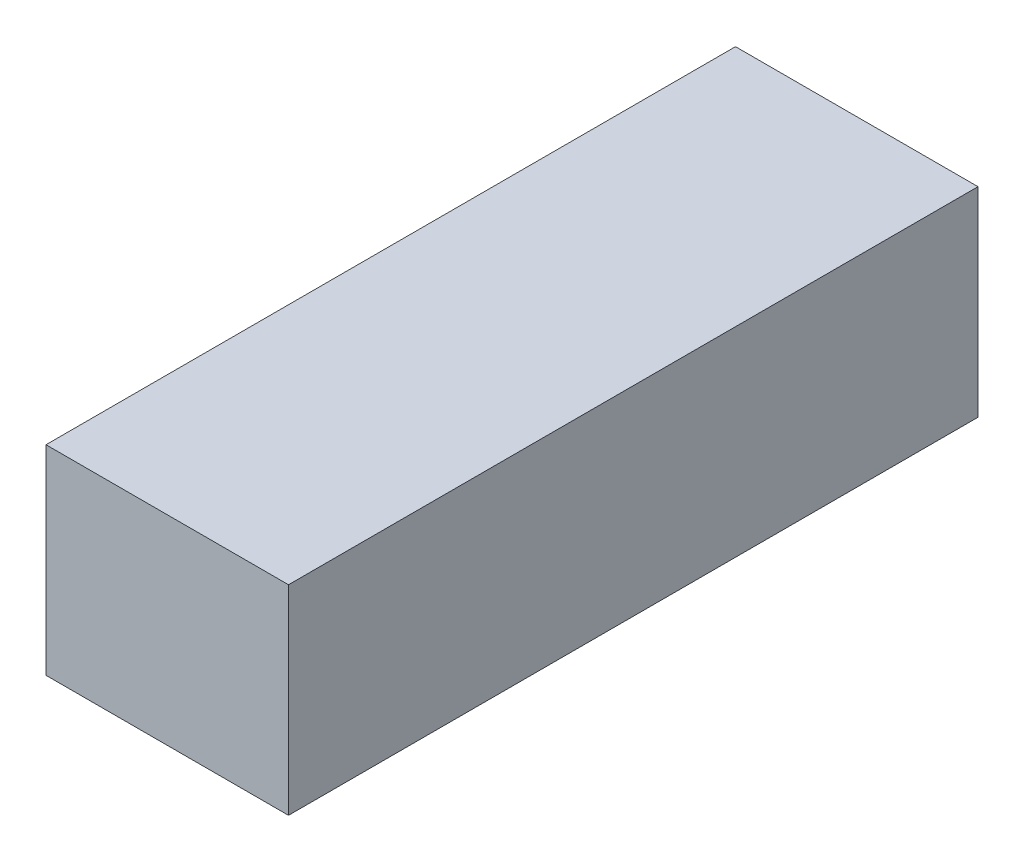
ISO-10303-21;
HEADER;
FILE_DESCRIPTION(('STEP AP214'),'2;1');
FILE_NAME('part.step','',(''),(''),'','','');
FILE_SCHEMA(('AUTOMOTIVE_DESIGN { 1 0 10303 214 1 1 1 1 }'));
ENDSEC;
DATA;
#1=APPLICATION_CONTEXT('core data for automotive mechanical design processes');
#2=APPLICATION_PROTOCOL_DEFINITION('international standard','automotive_design',2000,#1);
#3=PRODUCT_CONTEXT('',#1,'mechanical');
#4=PRODUCT('Part','Part','',(#3));
#5=PRODUCT_RELATED_PRODUCT_CATEGORY('part','',(#4));
#6=PRODUCT_DEFINITION_FORMATION('','',#4);
#7=PRODUCT_DEFINITION_CONTEXT('part definition',#1,'design');
#8=PRODUCT_DEFINITION('design','',#6,#7);
#9=PRODUCT_DEFINITION_SHAPE('','',#8);
#10=(LENGTH_UNIT() NAMED_UNIT(*) SI_UNIT(.MILLI.,.METRE.));
#11=(NAMED_UNIT(*) PLANE_ANGLE_UNIT() SI_UNIT($,.RADIAN.));
#12=(NAMED_UNIT(*) SI_UNIT($,.STERADIAN.) SOLID_ANGLE_UNIT());
#13=UNCERTAINTY_MEASURE_WITH_UNIT(LENGTH_MEASURE(1.E-05),#10,'distance_accuracy_value','');
#14=(GEOMETRIC_REPRESENTATION_CONTEXT(3) GLOBAL_UNCERTAINTY_ASSIGNED_CONTEXT((#13)) GLOBAL_UNIT_ASSIGNED_CONTEXT((#10,
#11,#12)) REPRESENTATION_CONTEXT('',''));
#15=CARTESIAN_POINT('',(0.,0.,0.));
#16=DIRECTION('',(0.,0.,1.));
#17=DIRECTION('',(1.,0.,0.));
#18=AXIS2_PLACEMENT_3D('',#15,#16,#17);
#19=CARTESIAN_POINT('',(25.5,-21.,145.));
#20=DIRECTION('',(-1.,0.,0.));
#21=DIRECTION('',(0.,0.,1.));
#22=AXIS2_PLACEMENT_3D('',#19,#20,#21);
#23=PLANE('',#22);
#24=DIRECTION('',(0.,1.,0.));
#25=VECTOR('',#24,1.);
#26=CARTESIAN_POINT('',(25.5,-21.,0.));
#27=LINE('',#26,#25);
#28=CARTESIAN_POINT('',(25.5,-21.,0.));
#29=VERTEX_POINT('',#28);
#30=CARTESIAN_POINT('',(25.5,21.,0.));
#31=VERTEX_POINT('',#30);
#32=EDGE_CURVE('E107',#29,#31,#27,.T.);
#33=ORIENTED_EDGE('',*,*,#32,.T.);
#34=DIRECTION('',(0.,0.,-1.));
#35=VECTOR('',#34,1.);
#36=CARTESIAN_POINT('',(25.5,21.,145.));
#37=LINE('',#36,#35);
#38=CARTESIAN_POINT('',(25.5,21.,145.));
#39=VERTEX_POINT('',#38);
#40=EDGE_CURVE('E11',#39,#31,#37,.T.);
#41=ORIENTED_EDGE('',*,*,#40,.F.);
#42=DIRECTION('',(0.,1.,0.));
#43=VECTOR('',#42,1.);
#44=CARTESIAN_POINT('',(25.5,-21.,145.));
#45=LINE('',#44,#43);
#46=CARTESIAN_POINT('',(25.5,-21.,145.));
#47=VERTEX_POINT('',#46);
#48=EDGE_CURVE('E91',#47,#39,#45,.T.);
#49=ORIENTED_EDGE('',*,*,#48,.F.);
#50=DIRECTION('',(0.,0.,-1.));
#51=VECTOR('',#50,1.);
#52=CARTESIAN_POINT('',(25.5,-21.,145.));
#53=LINE('',#52,#51);
#54=EDGE_CURVE('E103',#47,#29,#53,.T.);
#55=ORIENTED_EDGE('',*,*,#54,.T.);
#56=EDGE_LOOP('',(#33,#41,#49,#55));
#57=FACE_BOUND('',#56,.T.);
#58=ADVANCED_FACE('F39',(#57),#23,.F.);
#59=CARTESIAN_POINT('',(-25.5,21.,145.));
#60=DIRECTION('',(0.,-1.,0.));
#61=DIRECTION('',(0.,0.,-1.));
#62=AXIS2_PLACEMENT_3D('',#59,#60,#61);
#63=PLANE('',#62);
#64=DIRECTION('',(-1.,0.,0.));
#65=VECTOR('',#64,1.);
#66=CARTESIAN_POINT('',(-25.5,21.,0.));
#67=LINE('',#66,#65);
#68=CARTESIAN_POINT('',(-25.5,21.,0.));
#69=VERTEX_POINT('',#68);
#70=EDGE_CURVE('E96',#31,#69,#67,.T.);
#71=ORIENTED_EDGE('',*,*,#70,.T.);
#72=DIRECTION('',(0.,0.,-1.));
#73=VECTOR('',#72,1.);
#74=CARTESIAN_POINT('',(-25.5,21.,145.));
#75=LINE('',#74,#73);
#76=CARTESIAN_POINT('',(-25.5,21.,145.));
#77=VERTEX_POINT('',#76);
#78=EDGE_CURVE('E48',#77,#69,#75,.T.);
#79=ORIENTED_EDGE('',*,*,#78,.F.);
#80=DIRECTION('',(-1.,0.,0.));
#81=VECTOR('',#80,1.);
#82=CARTESIAN_POINT('',(-25.5,21.,145.));
#83=LINE('',#82,#81);
#84=EDGE_CURVE('E86',#39,#77,#83,.T.);
#85=ORIENTED_EDGE('',*,*,#84,.F.);
#86=ORIENTED_EDGE('',*,*,#40,.T.);
#87=EDGE_LOOP('',(#71,#79,#85,#86));
#88=FACE_BOUND('',#87,.T.);
#89=ADVANCED_FACE('F95',(#88),#63,.F.);
#90=CARTESIAN_POINT('',(-25.5,-21.,145.));
#91=DIRECTION('',(1.,0.,0.));
#92=DIRECTION('',(0.,0.,-1.));
#93=AXIS2_PLACEMENT_3D('',#90,#91,#92);
#94=PLANE('',#93);
#95=DIRECTION('',(0.,-1.,0.));
#96=VECTOR('',#95,1.);
#97=CARTESIAN_POINT('',(-25.5,-21.,0.));
#98=LINE('',#97,#96);
#99=CARTESIAN_POINT('',(-25.5,-21.,0.));
#100=VERTEX_POINT('',#99);
#101=EDGE_CURVE('E73',#69,#100,#98,.T.);
#102=ORIENTED_EDGE('',*,*,#101,.T.);
#103=DIRECTION('',(0.,0.,-1.));
#104=VECTOR('',#103,1.);
#105=CARTESIAN_POINT('',(-25.5,-21.,145.));
#106=LINE('',#105,#104);
#107=CARTESIAN_POINT('',(-25.5,-21.,145.));
#108=VERTEX_POINT('',#107);
#109=EDGE_CURVE('E98',#108,#100,#106,.T.);
#110=ORIENTED_EDGE('',*,*,#109,.F.);
#111=DIRECTION('',(0.,-1.,0.));
#112=VECTOR('',#111,1.);
#113=CARTESIAN_POINT('',(-25.5,-21.,145.));
#114=LINE('',#113,#112);
#115=EDGE_CURVE('E89',#77,#108,#114,.T.);
#116=ORIENTED_EDGE('',*,*,#115,.F.);
#117=ORIENTED_EDGE('',*,*,#78,.T.);
#118=EDGE_LOOP('',(#102,#110,#116,#117));
#119=FACE_BOUND('',#118,.T.);
#120=ADVANCED_FACE('F99',(#119),#94,.F.);
#121=CARTESIAN_POINT('',(-25.5,-21.,145.));
#122=DIRECTION('',(0.,1.,0.));
#123=DIRECTION('',(0.,0.,1.));
#124=AXIS2_PLACEMENT_3D('',#121,#122,#123);
#125=PLANE('',#124);
#126=DIRECTION('',(1.,0.,0.));
#127=VECTOR('',#126,1.);
#128=CARTESIAN_POINT('',(-25.5,-21.,0.));
#129=LINE('',#128,#127);
#130=EDGE_CURVE('E79',#100,#29,#129,.T.);
#131=ORIENTED_EDGE('',*,*,#130,.T.);
#132=ORIENTED_EDGE('',*,*,#54,.F.);
#133=DIRECTION('',(1.,0.,0.));
#134=VECTOR('',#133,1.);
#135=CARTESIAN_POINT('',(-25.5,-21.,145.));
#136=LINE('',#135,#134);
#137=EDGE_CURVE('E56',#108,#47,#136,.T.);
#138=ORIENTED_EDGE('',*,*,#137,.F.);
#139=ORIENTED_EDGE('',*,*,#109,.T.);
#140=EDGE_LOOP('',(#131,#132,#138,#139));
#141=FACE_BOUND('',#140,.T.);
#142=ADVANCED_FACE('F120',(#141),#125,.F.);
#143=CARTESIAN_POINT('',(0.,0.,145.));
#144=DIRECTION('',(0.,0.,-1.));
#145=DIRECTION('',(-1.,0.,0.));
#146=AXIS2_PLACEMENT_3D('',#143,#144,#145);
#147=PLANE('',#146);
#148=ORIENTED_EDGE('',*,*,#48,.T.);
#149=ORIENTED_EDGE('',*,*,#84,.T.);
#150=ORIENTED_EDGE('',*,*,#115,.T.);
#151=ORIENTED_EDGE('',*,*,#137,.T.);
#152=EDGE_LOOP('',(#148,#149,#150,#151));
#153=FACE_BOUND('',#152,.T.);
#154=ADVANCED_FACE('F87',(#153),#147,.F.);
#155=CARTESIAN_POINT('',(0.,0.,0.));
#156=DIRECTION('',(0.,0.,-1.));
#157=DIRECTION('',(-1.,0.,0.));
#158=AXIS2_PLACEMENT_3D('',#155,#156,#157);
#159=PLANE('',#158);
#160=ORIENTED_EDGE('',*,*,#32,.F.);
#161=ORIENTED_EDGE('',*,*,#130,.F.);
#162=ORIENTED_EDGE('',*,*,#101,.F.);
#163=ORIENTED_EDGE('',*,*,#70,.F.);
#164=EDGE_LOOP('',(#160,#161,#162,#163));
#165=FACE_BOUND('',#164,.T.);
#166=ADVANCED_FACE('F123',(#165),#159,.T.);
#167=CLOSED_SHELL('',(#58,#89,#120,#142,#154,#166));
#168=MANIFOLD_SOLID_BREP('B2',#167);
#169=ADVANCED_BREP_SHAPE_REPRESENTATION('',(#18,#168),#14);
#170=SHAPE_DEFINITION_REPRESENTATION(#9,#169);
ENDSEC;
END-ISO-10303-21;
